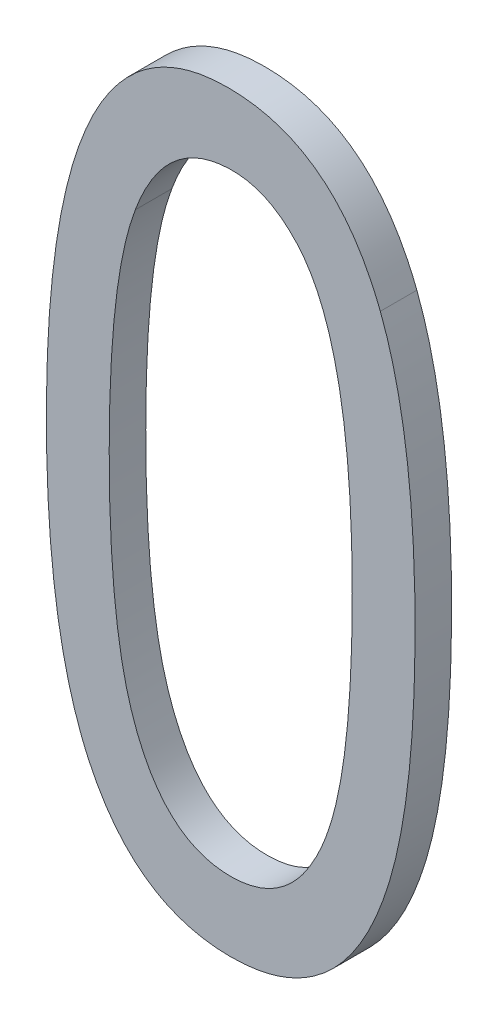
ISO-10303-21;
HEADER;
FILE_DESCRIPTION(('STEP AP214'),'2;1');
FILE_NAME('part.step','',(''),(''),'','','');
FILE_SCHEMA(('AUTOMOTIVE_DESIGN { 1 0 10303 214 1 1 1 1 }'));
ENDSEC;
DATA;
#1=APPLICATION_CONTEXT('core data for automotive mechanical design processes');
#2=APPLICATION_PROTOCOL_DEFINITION('international standard','automotive_design',2000,#1);
#3=PRODUCT_CONTEXT('',#1,'mechanical');
#4=PRODUCT('Part','Part','',(#3));
#5=PRODUCT_RELATED_PRODUCT_CATEGORY('part','',(#4));
#6=PRODUCT_DEFINITION_FORMATION('','',#4);
#7=PRODUCT_DEFINITION_CONTEXT('part definition',#1,'design');
#8=PRODUCT_DEFINITION('design','',#6,#7);
#9=PRODUCT_DEFINITION_SHAPE('','',#8);
#10=(LENGTH_UNIT() NAMED_UNIT(*) SI_UNIT(.MILLI.,.METRE.));
#11=(NAMED_UNIT(*) PLANE_ANGLE_UNIT() SI_UNIT($,.RADIAN.));
#12=(NAMED_UNIT(*) SI_UNIT($,.STERADIAN.) SOLID_ANGLE_UNIT());
#13=UNCERTAINTY_MEASURE_WITH_UNIT(LENGTH_MEASURE(1.E-05),#10,'distance_accuracy_value','');
#14=(GEOMETRIC_REPRESENTATION_CONTEXT(3) GLOBAL_UNCERTAINTY_ASSIGNED_CONTEXT((#13)) GLOBAL_UNIT_ASSIGNED_CONTEXT((#10,
#11,#12)) REPRESENTATION_CONTEXT('',''));
#15=CARTESIAN_POINT('',(0.,0.,0.));
#16=DIRECTION('',(0.,0.,1.));
#17=DIRECTION('',(1.,0.,0.));
#18=AXIS2_PLACEMENT_3D('',#15,#16,#17);
#19=CARTESIAN_POINT('',(179.238825130962,131.090958591415,-38.9997200126349));
#20=DIRECTION('',(0.,0.,-1.));
#21=DIRECTION('',(-1.,0.,0.));
#22=AXIS2_PLACEMENT_3D('',#19,#20,#21);
#23=PLANE('',#22);
#24=CARTESIAN_POINT('',(179.320638807875,130.864264361799,-38.9997200126349));
#25=CARTESIAN_POINT('',(179.314685794643,130.848475242088,-38.9997200126349));
#26=CARTESIAN_POINT('',(179.309419371186,130.832454429874,-38.9997200126349));
#27=CARTESIAN_POINT('',(179.299985103202,130.800117533578,-38.9997200126349));
#28=CARTESIAN_POINT('',(179.295815466405,130.783801978364,-38.9997200126349));
#29=CARTESIAN_POINT('',(179.284520896681,130.73460686473,-38.9997200126349));
#30=CARTESIAN_POINT('',(179.278603230467,130.701457754597,-38.9997200126349));
#31=CARTESIAN_POINT('',(179.267201559346,130.623785000682,-38.9997200126349));
#32=CARTESIAN_POINT('',(179.26251944956,130.579152646366,-38.9997200126349));
#33=CARTESIAN_POINT('',(179.255477133875,130.489674358544,-38.9997200126349));
#34=CARTESIAN_POINT('',(179.253119463016,130.444828245335,-38.9997200126349));
#35=CARTESIAN_POINT('',(179.250054403659,130.355024379923,-38.9997200126349));
#36=CARTESIAN_POINT('',(179.249349284686,130.310066558975,-38.9997200126349));
#37=CARTESIAN_POINT('',(179.2491379072,130.219951978565,-38.9997200126349));
#38=CARTESIAN_POINT('',(179.249636914405,130.174795210432,-38.9997200126349));
#39=CARTESIAN_POINT('',(179.252175301277,130.084581394692,-38.9997200126349));
#40=CARTESIAN_POINT('',(179.254212568807,130.039524295235,-38.9997200126349));
#41=CARTESIAN_POINT('',(179.26045579852,129.949595568297,-38.9997200126349));
#42=CARTESIAN_POINT('',(179.264659382687,129.904723791713,-38.9997200126349));
#43=CARTESIAN_POINT('',(179.275096147828,129.825658047955,-38.9997200126349));
#44=CARTESIAN_POINT('',(179.28064060053,129.791380774313,-38.9997200126349));
#45=CARTESIAN_POINT('',(179.291324308166,129.740489065222,-38.9997200126349));
#46=CARTESIAN_POINT('',(179.295274215558,129.723631408122,-38.9997200126349));
#47=CARTESIAN_POINT('',(179.304286370257,129.690216726647,-38.9997200126349));
#48=CARTESIAN_POINT('',(179.309348434505,129.673659653281,-38.9997200126349));
#49=CARTESIAN_POINT('',(179.322749702284,129.634573217558,-38.9997200126349));
#50=CARTESIAN_POINT('',(179.331598780762,129.612214848004,-38.9997200126349));
#51=CARTESIAN_POINT('',(179.352193685102,129.568817174476,-38.9997200126349));
#52=CARTESIAN_POINT('',(179.363936579213,129.547776562361,-38.9997200126349));
#53=CARTESIAN_POINT('',(179.386027060893,129.515886492571,-38.9997200126349));
#54=CARTESIAN_POINT('',(179.395183289491,129.504222752655,-38.9997200126349));
#55=CARTESIAN_POINT('',(179.415139040853,129.48241448985,-38.9997200126349));
#56=CARTESIAN_POINT('',(179.425934336452,129.472266188477,-38.9997200126349));
#57=CARTESIAN_POINT('',(179.449365366088,129.453957194679,-38.9997200126349));
#58=CARTESIAN_POINT('',(179.462024085917,129.445825341317,-38.9997200126349));
#59=CARTESIAN_POINT('',(179.488738232425,129.432320424252,-38.9997200126349));
#60=CARTESIAN_POINT('',(179.502792597463,129.42694528247,-38.9997200126349));
#61=CARTESIAN_POINT('',(179.529401194421,129.419746445154,-38.9997200126349));
#62=CARTESIAN_POINT('',(179.541844527036,129.417497668166,-38.9997200126349));
#63=CARTESIAN_POINT('',(179.566944901131,129.414881213968,-38.9997200126349));
#64=CARTESIAN_POINT('',(179.579602398832,129.414518250076,-38.9997200126349));
#65=CARTESIAN_POINT('',(179.606269773555,129.415602311855,-38.9997200126349));
#66=CARTESIAN_POINT('',(179.620272695775,129.417256156512,-38.9997200126349));
#67=CARTESIAN_POINT('',(179.647711244464,129.42310198542,-38.9997200126349));
#68=CARTESIAN_POINT('',(179.661148639356,129.427285312832,-38.9997200126349));
#69=CARTESIAN_POINT('',(179.68623709202,129.437840719023,-38.9997200126349));
#70=CARTESIAN_POINT('',(179.697946202855,129.444075574264,-38.9997200126349));
#71=CARTESIAN_POINT('',(179.720124621512,129.458467642927,-38.9997200126349));
#72=CARTESIAN_POINT('',(179.730592026699,129.466627750615,-38.9997200126349));
#73=CARTESIAN_POINT('',(179.753478582907,129.487422160129,-38.9997200126349));
#74=CARTESIAN_POINT('',(179.765364454956,129.500637077797,-38.9997200126349));
#75=CARTESIAN_POINT('',(179.786969151525,129.528773580962,-38.9997200126349));
#76=CARTESIAN_POINT('',(179.796677663589,129.543702801898,-38.9997200126349));
#77=CARTESIAN_POINT('',(179.812914598513,129.572180061341,-38.9997200126349));
#78=CARTESIAN_POINT('',(179.819702637564,129.585584456034,-38.9997200126349));
#79=CARTESIAN_POINT('',(179.832123653542,129.612729594924,-38.9997200126349));
#80=CARTESIAN_POINT('',(179.837769396233,129.626464450378,-38.9997200126349));
#81=CARTESIAN_POINT('',(179.842993005113,129.640336357564,-38.9997200126349));
#82=B_SPLINE_CURVE_WITH_KNOTS('',3,(#24,#25,#26,#27,#28,#29,#30,#31,#32,#33,#34,#35,#36,#37,#38,
#39,#40,#41,#42,#43,#44,#45,#46,#47,#48,#49,#50,#51,#52,#53,#54,#55,#56,#57,#58,#59,#60,#61,#62,
#63,#64,#65,#66,#67,#68,#69,#70,#71,#72,#73,#74,#75,#76,#77,#78,#79,#80,#81),.UNSPECIFIED.,.F.,
.F.,(4,2,2,2,2,2,2,2,2,2,2,2,2,2,2,2,2,2,2,2,2,2,2,2,2,2,2,2,4),(0.,0.0505697521013991,
0.101056346902052,0.201963135015427,0.336501437363995,0.471186305792694,0.60605603492049,
0.741516625664598,0.876791557203544,1.01191830958994,1.11598120562329,1.16789468256163,
1.21979962096606,1.29181096162118,1.36374964472855,1.40810546546208,1.45234877662438,
1.49719243924359,1.5420022477071,1.57977700606879,1.61764613169972,1.65974753133225,
1.70170565331118,1.74128991218937,1.78093406227133,1.83395571191194,1.8872234159135,
1.93225019029305,1.97674197173794),.UNSPECIFIED.);
#83=CARTESIAN_POINT('',(179.320638807875,130.864264361799,-38.9997200126349));
#84=VERTEX_POINT('',#83);
#85=CARTESIAN_POINT('',(179.842993005113,129.640336357564,-38.9997200126349));
#86=VERTEX_POINT('',#85);
#87=EDGE_CURVE('E82',#84,#86,#82,.T.);
#88=ORIENTED_EDGE('',*,*,#87,.F.);
#89=CARTESIAN_POINT('',(179.842993005113,129.640336357564,-38.9997200126349));
#90=CARTESIAN_POINT('',(179.848900545025,129.656132944584,-38.9997200126349));
#91=CARTESIAN_POINT('',(179.854135003658,129.672155401784,-38.9997200126349));
#92=CARTESIAN_POINT('',(179.863523631775,129.70448939799,-38.9997200126349));
#93=CARTESIAN_POINT('',(179.867679515401,129.720800433742,-38.9997200126349));
#94=CARTESIAN_POINT('',(179.878948597557,129.769988651637,-38.9997200126349));
#95=CARTESIAN_POINT('',(179.884867018757,129.803132311392,-38.9997200126349));
#96=CARTESIAN_POINT('',(179.896289019593,129.880830542612,-38.9997200126349));
#97=CARTESIAN_POINT('',(179.900991789311,129.925494025505,-38.9997200126349));
#98=CARTESIAN_POINT('',(179.90807131349,130.015036056765,-38.9997200126349));
#99=CARTESIAN_POINT('',(179.91044551084,130.059914787302,-38.9997200126349));
#100=CARTESIAN_POINT('',(179.913550851396,130.149785676277,-38.9997200126349));
#101=CARTESIAN_POINT('',(179.914279688774,130.194777905545,-38.9997200126349));
#102=CARTESIAN_POINT('',(179.914490656167,130.284934462767,-38.9997200126349));
#103=CARTESIAN_POINT('',(179.913968096369,130.330098802803,-38.9997200126349));
#104=CARTESIAN_POINT('',(179.911231497166,130.420316878215,-38.9997200126349));
#105=CARTESIAN_POINT('',(179.909019919395,130.465370678913,-38.9997200126349));
#106=CARTESIAN_POINT('',(179.902318691174,130.55526623786,-38.9997200126349));
#107=CARTESIAN_POINT('',(179.897831895662,130.600108190934,-38.9997200126349));
#108=CARTESIAN_POINT('',(179.886938256973,130.679049407534,-38.9997200126349));
#109=CARTESIAN_POINT('',(179.881214576846,130.713236890861,-38.9997200126349));
#110=CARTESIAN_POINT('',(179.870480162313,130.764062587247,-38.9997200126349));
#111=CARTESIAN_POINT('',(179.8665449694,130.78092493017,-38.9997200126349));
#112=CARTESIAN_POINT('',(179.857782873257,130.814407870121,-38.9997200126349));
#113=CARTESIAN_POINT('',(179.852956369485,130.831028571859,-38.9997200126349));
#114=CARTESIAN_POINT('',(179.840385853171,130.869406441959,-38.9997200126349));
#115=CARTESIAN_POINT('',(179.832205544478,130.891030440105,-38.9997200126349));
#116=CARTESIAN_POINT('',(179.817835488269,130.922480718343,-38.9997200126349));
#117=CARTESIAN_POINT('',(179.812702496497,130.932788799311,-38.9997200126349));
#118=CARTESIAN_POINT('',(179.801597000204,130.952936420333,-38.9997200126349));
#119=CARTESIAN_POINT('',(179.795625512455,130.962776508817,-38.9997200126349));
#120=CARTESIAN_POINT('',(179.784660620117,130.978844704911,-38.9997200126349));
#121=CARTESIAN_POINT('',(179.779931998641,130.985252237368,-38.9997200126349));
#122=CARTESIAN_POINT('',(179.76996711532,130.997659499494,-38.9997200126349));
#123=CARTESIAN_POINT('',(179.764730584684,131.003659010346,-38.9997200126349));
#124=CARTESIAN_POINT('',(179.748417267788,131.021119267774,-38.9997200126349));
#125=CARTESIAN_POINT('',(179.736737496291,131.032040695328,-38.9997200126349));
#126=CARTESIAN_POINT('',(179.714023817622,131.049727698336,-38.9997200126349));
#127=CARTESIAN_POINT('',(179.70330148318,131.056888521978,-38.9997200126349));
#128=CARTESIAN_POINT('',(179.680841446182,131.069305733308,-38.9997200126349));
#129=CARTESIAN_POINT('',(179.669107595929,131.074568982478,-38.9997200126349));
#130=CARTESIAN_POINT('',(179.644819537951,131.082900861981,-38.9997200126349));
#131=CARTESIAN_POINT('',(179.632262145771,131.08596034952,-38.9997200126349));
#132=CARTESIAN_POINT('',(179.613163387831,131.088835338516,-38.9997200126349));
#133=CARTESIAN_POINT('',(179.606739112858,131.089507543054,-38.9997200126349));
#134=CARTESIAN_POINT('',(179.593855133326,131.090279576979,-38.9997200126349));
#135=CARTESIAN_POINT('',(179.5873954135,131.090379136528,-38.9997200126349));
#136=CARTESIAN_POINT('',(179.568577490339,131.090023396089,-38.9997200126349));
#137=CARTESIAN_POINT('',(179.556224847592,131.088977739146,-38.9997200126349));
#138=CARTESIAN_POINT('',(179.531830978786,131.085060073216,-38.9997200126349));
#139=CARTESIAN_POINT('',(179.519789162678,131.08219183763,-38.9997200126349));
#140=CARTESIAN_POINT('',(179.494617181036,131.07397811753,-38.9997200126349));
#141=CARTESIAN_POINT('',(179.481582449831,131.068333691532,-38.9997200126349));
#142=CARTESIAN_POINT('',(179.456794788347,131.054729287914,-38.9997200126349));
#143=CARTESIAN_POINT('',(179.445042099376,131.046768875404,-38.9997200126349));
#144=CARTESIAN_POINT('',(179.421180625092,131.027490389244,-38.9997200126349));
#145=CARTESIAN_POINT('',(179.409350316107,131.015831683925,-38.9997200126349));
#146=CARTESIAN_POINT('',(179.387660380167,130.99073318987,-38.9997200126349));
#147=CARTESIAN_POINT('',(179.377812649714,130.977283409529,-38.9997200126349));
#148=CARTESIAN_POINT('',(179.358844898035,130.94767383249,-38.9997200126349));
#149=CARTESIAN_POINT('',(179.349939393276,130.931380333798,-38.9997200126349));
#150=CARTESIAN_POINT('',(179.334032894161,130.898196417025,-38.9997200126349));
#151=CARTESIAN_POINT('',(179.327003889302,130.881319595501,-38.9997200126349));
#152=CARTESIAN_POINT('',(179.320638807875,130.864264361799,-38.9997200126349));
#153=B_SPLINE_CURVE_WITH_KNOTS('',3,(#89,#90,#91,#92,#93,#94,#95,#96,#97,#98,#99,#100,#101,#102,
#103,#104,#105,#106,#107,#108,#109,#110,#111,#112,#113,#114,#115,#116,#117,#118,#119,#120,#121,
#122,#123,#124,#125,#126,#127,#128,#129,#130,#131,#132,#133,#134,#135,#136,#137,#138,#139,#140,
#141,#142,#143,#144,#145,#146,#147,#148,#149,#150,#151,#152),.UNSPECIFIED.,.F.,.F.,(4,2,2,2,2,2,
2,2,2,2,2,2,2,2,2,2,2,2,2,2,2,2,2,2,2,2,2,2,2,2,2,4),(0.,0.0505451263481058,0.101009424248054,
0.201902267541713,0.336539886851845,0.471325192870273,0.606299271702893,0.741779978745445,
0.877063607287282,1.01217790073845,1.11607361424897,1.16799878628324,1.21990074317894,
1.28909095466454,1.32360838480802,1.3580843144087,1.38194736016673,1.40582310408443,
1.45357840362639,1.49210254296722,1.53048595084583,1.56902769771647,1.58838285091988,
1.60774712377245,1.64481149010117,1.68179936861829,1.7241515020703,1.76651159345758,
1.81606544779566,1.86590832630645,1.92149301694768,1.97619459018589),.UNSPECIFIED.);
#154=EDGE_CURVE('E80',#86,#84,#153,.T.);
#155=ORIENTED_EDGE('',*,*,#154,.F.);
#156=EDGE_LOOP('',(#88,#155));
#157=FACE_BOUND('',#156,.T.);
#158=CARTESIAN_POINT('',(179.991239144299,130.959023493615,-38.9997200126349));
#159=CARTESIAN_POINT('',(179.997279954319,130.943337899789,-38.9997200126349));
#160=CARTESIAN_POINT('',(180.002861694794,130.927484629563,-38.9997200126349));
#161=CARTESIAN_POINT('',(180.013219112892,130.895528883182,-38.9997200126349));
#162=CARTESIAN_POINT('',(180.017995390848,130.879426602482,-38.9997200126349));
#163=CARTESIAN_POINT('',(180.031264177263,130.830956917848,-38.9997200126349));
#164=CARTESIAN_POINT('',(180.038738661402,130.798312063508,-38.9997200126349));
#165=CARTESIAN_POINT('',(180.05381473309,130.721440274453,-38.9997200126349));
#166=CARTESIAN_POINT('',(180.060591658904,130.677057385156,-38.9997200126349));
#167=CARTESIAN_POINT('',(180.071456152305,130.58792176834,-38.9997200126349));
#168=CARTESIAN_POINT('',(180.07554003602,130.543168618663,-38.9997200126349));
#169=CARTESIAN_POINT('',(180.081649699088,130.453478301139,-38.9997200126349));
#170=CARTESIAN_POINT('',(180.083673145548,130.408540982415,-38.9997200126349));
#171=CARTESIAN_POINT('',(180.086114123818,130.31823868764,-38.9997200126349));
#172=CARTESIAN_POINT('',(180.08651760574,130.272873376238,-38.9997200126349));
#173=CARTESIAN_POINT('',(180.08595999745,130.182200324325,-38.9997200126349));
#174=CARTESIAN_POINT('',(180.085000395862,130.136892575012,-38.9997200126349));
#175=CARTESIAN_POINT('',(180.081319006026,130.046367839625,-38.9997200126349));
#176=CARTESIAN_POINT('',(180.078598284138,130.001150815226,-38.9997200126349));
#177=CARTESIAN_POINT('',(180.071845514524,129.922382201833,-38.9997200126349));
#178=CARTESIAN_POINT('',(180.068322807889,129.888787897993,-38.9997200126349));
#179=CARTESIAN_POINT('',(180.059663899228,129.82181056423,-38.9997200126349));
#180=CARTESIAN_POINT('',(180.05452811688,129.788427481655,-38.9997200126349));
#181=CARTESIAN_POINT('',(180.04224018035,129.72227678713,-38.9997200126349));
#182=CARTESIAN_POINT('',(180.035103266111,129.689506446587,-38.9997200126349));
#183=CARTESIAN_POINT('',(180.018052418192,129.624710527528,-38.9997200126349));
#184=CARTESIAN_POINT('',(180.008141590706,129.592684159116,-38.9997200126349));
#185=CARTESIAN_POINT('',(179.986916223294,129.53507714258,-38.9997200126349));
#186=CARTESIAN_POINT('',(179.976110659592,129.509311580616,-38.9997200126349));
#187=CARTESIAN_POINT('',(179.951590549176,129.4590920697,-38.9997200126349));
#188=CARTESIAN_POINT('',(179.937869433069,129.434641241708,-38.9997200126349));
#189=CARTESIAN_POINT('',(179.906674028944,129.387668977202,-38.9997200126349));
#190=CARTESIAN_POINT('',(179.8891472204,129.36518143479,-38.9997200126349));
#191=CARTESIAN_POINT('',(179.850064515502,129.324076248212,-38.9997200126349));
#192=CARTESIAN_POINT('',(179.82852648136,129.305442191969,-38.9997200126349));
#193=CARTESIAN_POINT('',(179.787884026461,129.277732791769,-38.9997200126349));
#194=CARTESIAN_POINT('',(179.769612641535,129.26743201411,-38.9997200126349));
#195=CARTESIAN_POINT('',(179.731559011488,129.2501474644,-38.9997200126349));
#196=CARTESIAN_POINT('',(179.711776577115,129.243164108632,-38.9997200126349));
#197=CARTESIAN_POINT('',(179.671481891564,129.232565499357,-38.9997200126349));
#198=CARTESIAN_POINT('',(179.650974966847,129.22892949367,-38.9997200126349));
#199=CARTESIAN_POINT('',(179.609623974871,129.224560184324,-38.9997200126349));
#200=CARTESIAN_POINT('',(179.588779113837,129.223835176074,-38.9997200126349));
#201=CARTESIAN_POINT('',(179.54326347764,129.225126635684,-38.9997200126349));
#202=CARTESIAN_POINT('',(179.518603038074,129.227678718281,-38.9997200126349));
#203=CARTESIAN_POINT('',(179.470222641752,129.237298330561,-38.9997200126349));
#204=CARTESIAN_POINT('',(179.446499481735,129.244348751809,-38.9997200126349));
#205=CARTESIAN_POINT('',(179.402467319328,129.262500665746,-38.9997200126349));
#206=CARTESIAN_POINT('',(179.382036419953,129.273305776927,-38.9997200126349));
#207=CARTESIAN_POINT('',(179.343545797162,129.29855698438,-38.9997200126349));
#208=CARTESIAN_POINT('',(179.325489496793,129.313008251029,-38.9997200126349));
#209=CARTESIAN_POINT('',(179.289059250212,129.347562151279,-38.9997200126349));
#210=CARTESIAN_POINT('',(179.271213305426,129.368213821031,-38.9997200126349));
#211=CARTESIAN_POINT('',(179.238999710773,129.412100721718,-38.9997200126349));
#212=CARTESIAN_POINT('',(179.224643056591,129.4353437916,-38.9997200126349));
#213=CARTESIAN_POINT('',(179.204246574083,129.473421924732,-38.9997200126349));
#214=CARTESIAN_POINT('',(179.197225345485,129.487750819333,-38.9997200126349));
#215=CARTESIAN_POINT('',(179.184141578985,129.516708809978,-38.9997200126349));
#216=CARTESIAN_POINT('',(179.178072079893,129.531334747628,-38.9997200126349));
#217=CARTESIAN_POINT('',(179.172392668689,129.546106606373,-38.9997200126349));
#218=B_SPLINE_CURVE_WITH_KNOTS('',3,(#158,#159,#160,#161,#162,#163,#164,#165,#166,#167,#168,
#169,#170,#171,#172,#173,#174,#175,#176,#177,#178,#179,#180,#181,#182,#183,#184,#185,#186,#187,
#188,#189,#190,#191,#192,#193,#194,#195,#196,#197,#198,#199,#200,#201,#202,#203,#204,#205,#206,
#207,#208,#209,#210,#211,#212,#213,#214,#215,#216,#217),.UNSPECIFIED.,.F.,.F.,(4,2,2,2,2,2,2,2,
2,2,2,2,2,2,2,2,2,2,2,2,2,2,2,2,2,2,2,2,2,4),(0.,0.0504059167910866,0.10077409696502,
0.201145630119228,0.335720898441017,0.470479875519735,0.605391261949206,0.741470234259105,
0.877400708844844,1.01324895426801,1.11455472333155,1.21583415718658,1.31636230542943,
1.41677833076473,1.50046425327382,1.58434077728168,1.66945814898841,1.75420517810554,
1.81682345639516,1.87944959019663,1.9416848007098,2.00409723628632,2.07813118924437,
2.1518852353992,2.22079670750336,2.28980645318111,2.37123966682024,2.45292626433536,
2.50076964590169,2.54824488311769),.UNSPECIFIED.);
#219=CARTESIAN_POINT('',(179.991239144299,130.959023493615,-38.9997200126349));
#220=VERTEX_POINT('',#219);
#221=CARTESIAN_POINT('',(179.172392668689,129.546106606373,-38.9997200126349));
#222=VERTEX_POINT('',#221);
#223=EDGE_CURVE('E67',#220,#222,#218,.T.);
#224=ORIENTED_EDGE('',*,*,#223,.F.);
#225=CARTESIAN_POINT('',(179.172392668689,129.546106606373,-38.9997200126349));
#226=CARTESIAN_POINT('',(179.166370248839,129.561795160987,-38.9997200126349));
#227=CARTESIAN_POINT('',(179.160805188863,129.577650211671,-38.9997200126349));
#228=CARTESIAN_POINT('',(179.150477523514,129.609607705384,-38.9997200126349));
#229=CARTESIAN_POINT('',(179.145714325733,129.625709956103,-38.9997200126349));
#230=CARTESIAN_POINT('',(179.132476159521,129.674188332918,-38.9997200126349));
#231=CARTESIAN_POINT('',(179.125014650968,129.706839972945,-38.9997200126349));
#232=CARTESIAN_POINT('',(179.109954533786,129.783735601387,-38.9997200126349));
#233=CARTESIAN_POINT('',(179.1031773126,129.828134722178,-38.9997200126349));
#234=CARTESIAN_POINT('',(179.092299758557,129.917301531891,-38.9997200126349));
#235=CARTESIAN_POINT('',(179.088203066712,129.962069638832,-38.9997200126349));
#236=CARTESIAN_POINT('',(179.082066858733,130.051791461034,-38.9997200126349));
#237=CARTESIAN_POINT('',(179.080029734156,130.096745331349,-38.9997200126349));
#238=CARTESIAN_POINT('',(179.077540897019,130.187059318706,-38.9997200126349));
#239=CARTESIAN_POINT('',(179.077102253894,130.232419758082,-38.9997200126349));
#240=CARTESIAN_POINT('',(179.077672187627,130.323081419516,-38.9997200126349));
#241=CARTESIAN_POINT('',(179.078679123937,130.368382650395,-38.9997200126349));
#242=CARTESIAN_POINT('',(179.082553146114,130.458883307037,-38.9997200126349));
#243=CARTESIAN_POINT('',(179.085418972272,130.504082780957,-38.9997200126349));
#244=CARTESIAN_POINT('',(179.092469763667,130.58277290308,-38.9997200126349));
#245=CARTESIAN_POINT('',(179.09613188189,130.61630973198,-38.9997200126349));
#246=CARTESIAN_POINT('',(179.105060609833,130.683192935084,-38.9997200126349));
#247=CARTESIAN_POINT('',(179.110328032479,130.716539204053,-38.9997200126349));
#248=CARTESIAN_POINT('',(179.122820371233,130.782623358916,-38.9997200126349));
#249=CARTESIAN_POINT('',(179.130030942571,130.815363895091,-38.9997200126349));
#250=CARTESIAN_POINT('',(179.146963557392,130.880176210977,-38.9997200126349));
#251=CARTESIAN_POINT('',(179.156682985665,130.912248649708,-38.9997200126349));
#252=CARTESIAN_POINT('',(179.177396408648,130.969686770112,-38.9997200126349));
#253=CARTESIAN_POINT('',(179.187864284684,130.995238656133,-38.9997200126349));
#254=CARTESIAN_POINT('',(179.211613094858,131.045101119168,-38.9997200126349));
#255=CARTESIAN_POINT('',(179.224899815797,131.06940901299,-38.9997200126349));
#256=CARTESIAN_POINT('',(179.255133397155,131.116209985718,-38.9997200126349));
#257=CARTESIAN_POINT('',(179.27213137979,131.13867098759,-38.9997200126349));
#258=CARTESIAN_POINT('',(179.310138292473,131.179869534896,-38.9997200126349));
#259=CARTESIAN_POINT('',(179.331130239943,131.198622183657,-38.9997200126349));
#260=CARTESIAN_POINT('',(179.370521313183,131.226346206264,-38.9997200126349));
#261=CARTESIAN_POINT('',(179.388027549969,131.236588093705,-38.9997200126349));
#262=CARTESIAN_POINT('',(179.424543714573,131.253879556555,-38.9997200126349));
#263=CARTESIAN_POINT('',(179.443552920858,131.260930652977,-38.9997200126349));
#264=CARTESIAN_POINT('',(179.482354390649,131.271769630551,-38.9997200126349));
#265=CARTESIAN_POINT('',(179.502141886101,131.275574879839,-38.9997200126349));
#266=CARTESIAN_POINT('',(179.54208891462,131.280263216907,-38.9997200126349));
#267=CARTESIAN_POINT('',(179.562249387494,131.281137483228,-38.9997200126349));
#268=CARTESIAN_POINT('',(179.605875414079,131.280450944094,-38.9997200126349));
#269=CARTESIAN_POINT('',(179.629335445731,131.278462935197,-38.9997200126349));
#270=CARTESIAN_POINT('',(179.675586814478,131.270679483559,-38.9997200126349));
#271=CARTESIAN_POINT('',(179.698379826546,131.264894621776,-38.9997200126349));
#272=CARTESIAN_POINT('',(179.743530292553,131.248845032742,-38.9997200126349));
#273=CARTESIAN_POINT('',(179.76582095716,131.238388787963,-38.9997200126349));
#274=CARTESIAN_POINT('',(179.807901612497,131.213282781825,-38.9997200126349));
#275=CARTESIAN_POINT('',(179.827690044012,131.198630424126,-38.9997200126349));
#276=CARTESIAN_POINT('',(179.865813422664,131.164661710575,-38.9997200126349));
#277=CARTESIAN_POINT('',(179.883888011223,131.145057595333,-38.9997200126349));
#278=CARTESIAN_POINT('',(179.916682559377,131.103166812801,-38.9997200126349));
#279=CARTESIAN_POINT('',(179.931390078072,131.080870647637,-38.9997200126349));
#280=CARTESIAN_POINT('',(179.953700916574,131.04186695711,-38.9997200126349));
#281=CARTESIAN_POINT('',(179.962087540968,131.025592244302,-38.9997200126349));
#282=CARTESIAN_POINT('',(179.977561504224,130.992612642449,-38.9997200126349));
#283=CARTESIAN_POINT('',(179.984659897533,130.975912968578,-38.9997200126349));
#284=CARTESIAN_POINT('',(179.991239144299,130.959023493615,-38.9997200126349));
#285=B_SPLINE_CURVE_WITH_KNOTS('',3,(#225,#226,#227,#228,#229,#230,#231,#232,#233,#234,#235,
#236,#237,#238,#239,#240,#241,#242,#243,#244,#245,#246,#247,#248,#249,#250,#251,#252,#253,#254,
#255,#256,#257,#258,#259,#260,#261,#262,#263,#264,#265,#266,#267,#268,#269,#270,#271,#272,#273,
#274,#275,#276,#277,#278,#279,#280,#281,#282,#283,#284),.UNSPECIFIED.,.F.,.F.,(4,2,2,2,2,2,2,2,
2,2,2,2,2,2,2,2,2,2,2,2,2,2,2,2,2,2,2,2,2,4),(0.,0.0503945271737219,0.100751658464276,
0.201135330613622,0.335760109523906,0.4705673741838,0.605530997154548,0.741595659025981,
0.877506026763376,1.01332438845357,1.1145033924107,1.21573371874455,1.3162362943295,
1.4166345270132,1.49934715414898,1.5822312539711,1.6663385498694,1.75009590114854,
1.81064867143636,1.87117254645638,1.93137049679794,1.99174946468789,2.06212675165344,
2.13230874124535,2.20567797210232,2.27909269851185,2.35865332061514,2.43850332819667,
2.49338201730299,2.54776487684637),.UNSPECIFIED.);
#286=EDGE_CURVE('E24',#222,#220,#285,.T.);
#287=ORIENTED_EDGE('',*,*,#286,.F.);
#288=EDGE_LOOP('',(#224,#287));
#289=FACE_BOUND('',#288,.T.);
#290=ADVANCED_FACE('F17',(#157,#289),#23,.F.);
#291=CARTESIAN_POINT('',(179.991239144299,130.959023493615,-39.0997200126349));
#292=CARTESIAN_POINT('',(179.991239144299,130.959023493615,-38.9997200126349));
#293=CARTESIAN_POINT('',(179.907802181145,131.173422646606,-39.0997200126349));
#294=CARTESIAN_POINT('',(179.907802181145,131.173422646606,-38.9997200126349));
#295=CARTESIAN_POINT('',(179.768481856621,131.280886913413,-39.0997200126349));
#296=CARTESIAN_POINT('',(179.768481856621,131.280886913413,-38.9997200126349));
#297=CARTESIAN_POINT('',(179.243023028196,131.280886913413,-39.0997200126349));
#298=CARTESIAN_POINT('',(179.243023028196,131.280886913413,-38.9997200126349));
#299=CARTESIAN_POINT('',(179.077313338582,130.938377649253,-39.0997200126349));
#300=CARTESIAN_POINT('',(179.077313338582,130.938377649253,-38.9997200126349));
#301=CARTESIAN_POINT('',(179.077313338582,129.946318358623,-39.0997200126349));
#302=CARTESIAN_POINT('',(179.077313338582,129.946318358623,-38.9997200126349));
#303=CARTESIAN_POINT('',(179.109135808251,129.710743980645,-39.0997200126349));
#304=CARTESIAN_POINT('',(179.109135808251,129.710743980645,-38.9997200126349));
#305=CARTESIAN_POINT('',(179.172392668689,129.546106606373,-39.0997200126349));
#306=CARTESIAN_POINT('',(179.172392668689,129.546106606373,-38.9997200126349));
#307=B_SPLINE_SURFACE_WITH_KNOTS('',3,1,((#291,#292),(#293,#294),(#295,#296),(#297,#298),(#299,
#300),(#301,#302),(#303,#304),(#305,#306)),.UNSPECIFIED.,.F.,.F.,.F.,(4,2,2,4),(2,2),(0.,
0.288697589169659,0.78023260625893,1.),(1.,1.09999999999999),.UNSPECIFIED.);
#308=CARTESIAN_POINT('',(179.172392668689,129.546106606373,-39.0997200126349));
#309=CARTESIAN_POINT('',(179.166370248839,129.561795160987,-39.0997200126349));
#310=CARTESIAN_POINT('',(179.160805188863,129.577650211671,-39.0997200126349));
#311=CARTESIAN_POINT('',(179.150477523514,129.609607705384,-39.0997200126349));
#312=CARTESIAN_POINT('',(179.145714325733,129.625709956103,-39.0997200126349));
#313=CARTESIAN_POINT('',(179.132476159521,129.674188332918,-39.0997200126349));
#314=CARTESIAN_POINT('',(179.125014650968,129.706839972945,-39.0997200126349));
#315=CARTESIAN_POINT('',(179.109954533786,129.783735601387,-39.0997200126349));
#316=CARTESIAN_POINT('',(179.1031773126,129.828134722178,-39.0997200126349));
#317=CARTESIAN_POINT('',(179.092299758557,129.917301531891,-39.0997200126349));
#318=CARTESIAN_POINT('',(179.088203066712,129.962069638832,-39.0997200126349));
#319=CARTESIAN_POINT('',(179.082066858733,130.051791461034,-39.0997200126349));
#320=CARTESIAN_POINT('',(179.080029734156,130.096745331349,-39.0997200126349));
#321=CARTESIAN_POINT('',(179.077540897019,130.187059318706,-39.0997200126349));
#322=CARTESIAN_POINT('',(179.077102253894,130.232419758082,-39.0997200126349));
#323=CARTESIAN_POINT('',(179.077672187628,130.323081419516,-39.0997200126349));
#324=CARTESIAN_POINT('',(179.078679123937,130.368382650395,-39.0997200126349));
#325=CARTESIAN_POINT('',(179.082553146114,130.458883307037,-39.0997200126349));
#326=CARTESIAN_POINT('',(179.085418972272,130.504082780957,-39.0997200126349));
#327=CARTESIAN_POINT('',(179.092469763667,130.58277290308,-39.0997200126349));
#328=CARTESIAN_POINT('',(179.09613188189,130.61630973198,-39.0997200126349));
#329=CARTESIAN_POINT('',(179.105060609833,130.683192935084,-39.0997200126349));
#330=CARTESIAN_POINT('',(179.110328032479,130.716539204053,-39.0997200126349));
#331=CARTESIAN_POINT('',(179.122820371233,130.782623358916,-39.0997200126349));
#332=CARTESIAN_POINT('',(179.130030942571,130.815363895091,-39.0997200126349));
#333=CARTESIAN_POINT('',(179.146963557392,130.880176210977,-39.0997200126349));
#334=CARTESIAN_POINT('',(179.156682985665,130.912248649708,-39.0997200126349));
#335=CARTESIAN_POINT('',(179.177396408648,130.969686770112,-39.0997200126349));
#336=CARTESIAN_POINT('',(179.187864284684,130.995238656133,-39.0997200126349));
#337=CARTESIAN_POINT('',(179.211613094858,131.045101119168,-39.0997200126349));
#338=CARTESIAN_POINT('',(179.224899815797,131.06940901299,-39.0997200126349));
#339=CARTESIAN_POINT('',(179.255133397155,131.116209985718,-39.0997200126349));
#340=CARTESIAN_POINT('',(179.27213137979,131.13867098759,-39.0997200126349));
#341=CARTESIAN_POINT('',(179.310138292473,131.179869534896,-39.0997200126349));
#342=CARTESIAN_POINT('',(179.331130239943,131.198622183657,-39.0997200126349));
#343=CARTESIAN_POINT('',(179.370521313183,131.226346206264,-39.0997200126349));
#344=CARTESIAN_POINT('',(179.388027549969,131.236588093705,-39.0997200126349));
#345=CARTESIAN_POINT('',(179.424543714573,131.253879556555,-39.0997200126349));
#346=CARTESIAN_POINT('',(179.443552920858,131.260930652977,-39.0997200126349));
#347=CARTESIAN_POINT('',(179.482354390649,131.271769630551,-39.0997200126349));
#348=CARTESIAN_POINT('',(179.502141886101,131.275574879839,-39.0997200126349));
#349=CARTESIAN_POINT('',(179.54208891462,131.280263216907,-39.0997200126349));
#350=CARTESIAN_POINT('',(179.562249387494,131.281137483228,-39.0997200126349));
#351=CARTESIAN_POINT('',(179.605875414079,131.280450944094,-39.0997200126349));
#352=CARTESIAN_POINT('',(179.629335445731,131.278462935197,-39.0997200126349));
#353=CARTESIAN_POINT('',(179.675586814478,131.270679483559,-39.0997200126349));
#354=CARTESIAN_POINT('',(179.698379826546,131.264894621777,-39.0997200126349));
#355=CARTESIAN_POINT('',(179.743530292553,131.248845032742,-39.0997200126349));
#356=CARTESIAN_POINT('',(179.76582095716,131.238388787963,-39.0997200126349));
#357=CARTESIAN_POINT('',(179.807901612497,131.213282781824,-39.0997200126349));
#358=CARTESIAN_POINT('',(179.827690044012,131.198630424126,-39.0997200126349));
#359=CARTESIAN_POINT('',(179.865813422664,131.164661710575,-39.0997200126349));
#360=CARTESIAN_POINT('',(179.883888011222,131.145057595333,-39.0997200126349));
#361=CARTESIAN_POINT('',(179.916682559377,131.103166812801,-39.0997200126349));
#362=CARTESIAN_POINT('',(179.931390078072,131.080870647637,-39.0997200126349));
#363=CARTESIAN_POINT('',(179.953700916574,131.04186695711,-39.0997200126349));
#364=CARTESIAN_POINT('',(179.962087540968,131.025592244302,-39.0997200126349));
#365=CARTESIAN_POINT('',(179.977561504224,130.992612642449,-39.0997200126349));
#366=CARTESIAN_POINT('',(179.984659897533,130.975912968578,-39.0997200126349));
#367=CARTESIAN_POINT('',(179.991239144299,130.959023493615,-39.0997200126349));
#368=B_SPLINE_CURVE_WITH_KNOTS('',3,(#308,#309,#310,#311,#312,#313,#314,#315,#316,#317,#318,
#319,#320,#321,#322,#323,#324,#325,#326,#327,#328,#329,#330,#331,#332,#333,#334,#335,#336,#337,
#338,#339,#340,#341,#342,#343,#344,#345,#346,#347,#348,#349,#350,#351,#352,#353,#354,#355,#356,
#357,#358,#359,#360,#361,#362,#363,#364,#365,#366,#367),.UNSPECIFIED.,.F.,.F.,(4,2,2,2,2,2,2,2,
2,2,2,2,2,2,2,2,2,2,2,2,2,2,2,2,2,2,2,2,2,4),(0.,0.0503945271737034,0.100751658464255,
0.201135330613621,0.335760109523901,0.470567374183798,0.605530997154547,0.741595659025979,
0.877506026763375,1.01332438845357,1.1145033924107,1.21573371874454,1.31623629432947,
1.41663452701319,1.49934715414898,1.5822312539711,1.66633854986938,1.75009590114855,
1.81064867143628,1.87117254645627,1.93137049679791,1.99174946468792,2.0621267516535,
2.13230874124539,2.20567797210231,2.27909269851185,2.35865332061516,2.43850332819668,
2.49338201730297,2.54776487684637),.UNSPECIFIED.);
#369=CARTESIAN_POINT('',(179.172392668689,129.546106606373,-39.0997200126349));
#370=VERTEX_POINT('',#369);
#371=CARTESIAN_POINT('',(179.991239144299,130.959023493615,-39.0997200126349));
#372=VERTEX_POINT('',#371);
#373=EDGE_CURVE('E111',#370,#372,#368,.T.);
#374=DIRECTION('',(0.,0.,-1.));
#375=VECTOR('',#374,1.);
#376=CARTESIAN_POINT('',(179.172392668689,129.546106606373,-39.0497200126349));
#377=LINE('',#376,#375);
#378=EDGE_CURVE('E71',#222,#370,#377,.T.);
#379=DIRECTION('',(0.,0.,1.));
#380=VECTOR('',#379,1.);
#381=CARTESIAN_POINT('',(179.991239144299,130.959023493615,-39.0497200126349));
#382=LINE('',#381,#380);
#383=EDGE_CURVE('E74',#372,#220,#382,.T.);
#384=ORIENTED_EDGE('',*,*,#373,.F.);
#385=ORIENTED_EDGE('',*,*,#378,.F.);
#386=ORIENTED_EDGE('',*,*,#286,.T.);
#387=ORIENTED_EDGE('',*,*,#383,.F.);
#388=EDGE_LOOP('',(#384,#385,#386,#387));
#389=FACE_BOUND('',#388,.T.);
#390=ADVANCED_FACE('F73',(#389),#307,.T.);
#391=CARTESIAN_POINT('',(179.172392668689,129.546106606373,-39.0997200126349));
#392=CARTESIAN_POINT('',(179.172392668689,129.546106606373,-38.9997200126349));
#393=CARTESIAN_POINT('',(179.255133609732,129.330758402497,-39.0997200126349));
#394=CARTESIAN_POINT('',(179.255133609732,129.330758402497,-38.9997200126349));
#395=CARTESIAN_POINT('',(179.392433404078,129.224243186574,-39.0997200126349));
#396=CARTESIAN_POINT('',(179.392433404078,129.224243186574,-38.9997200126349));
#397=CARTESIAN_POINT('',(179.786721564846,129.224243186574,-39.0997200126349));
#398=CARTESIAN_POINT('',(179.786721564846,129.224243186574,-38.9997200126349));
#399=CARTESIAN_POINT('',(179.929922678353,129.350235775245,-39.0997200126349));
#400=CARTESIAN_POINT('',(179.929922678353,129.350235775245,-38.9997200126349));
#401=CARTESIAN_POINT('',(180.061324097569,129.760432026344,-39.0997200126349));
#402=CARTESIAN_POINT('',(180.061324097569,129.760432026344,-38.9997200126349));
#403=CARTESIAN_POINT('',(180.086318474406,129.977551815478,-39.0997200126349));
#404=CARTESIAN_POINT('',(180.086318474406,129.977551815478,-38.9997200126349));
#405=CARTESIAN_POINT('',(180.086318474406,130.560399883239,-39.0997200126349));
#406=CARTESIAN_POINT('',(180.086318474406,130.560399883239,-38.9997200126349));
#407=CARTESIAN_POINT('',(180.054496004737,130.794915499967,-39.0997200126349));
#408=CARTESIAN_POINT('',(180.054496004737,130.794915499967,-38.9997200126349));
#409=CARTESIAN_POINT('',(179.991239144299,130.959023493615,-39.0997200126349));
#410=CARTESIAN_POINT('',(179.991239144299,130.959023493615,-38.9997200126349));
#411=B_SPLINE_SURFACE_WITH_KNOTS('',3,1,((#391,#392),(#393,#394),(#395,#396),(#397,#398),(#399,
#400),(#401,#402),(#403,#404),(#405,#406),(#407,#408),(#409,#410)),.UNSPECIFIED.,.F.,.F.,.F.,(4,
2,2,2,4),(2,2),(0.,0.28393143238996,0.592349764493229,0.785992882722152,1.),(1.,
1.09999999999999),.UNSPECIFIED.);
#412=CARTESIAN_POINT('',(179.991239144299,130.959023493615,-39.0997200126349));
#413=CARTESIAN_POINT('',(179.997279954319,130.943337899789,-39.0997200126349));
#414=CARTESIAN_POINT('',(180.002861694794,130.927484629563,-39.0997200126349));
#415=CARTESIAN_POINT('',(180.013219112892,130.895528883182,-39.0997200126349));
#416=CARTESIAN_POINT('',(180.017995390848,130.879426602482,-39.0997200126349));
#417=CARTESIAN_POINT('',(180.031264177263,130.830956917848,-39.0997200126349));
#418=CARTESIAN_POINT('',(180.038738661402,130.798312063508,-39.0997200126349));
#419=CARTESIAN_POINT('',(180.05381473309,130.721440274453,-39.0997200126349));
#420=CARTESIAN_POINT('',(180.060591658904,130.677057385156,-39.0997200126349));
#421=CARTESIAN_POINT('',(180.071456152305,130.58792176834,-39.0997200126349));
#422=CARTESIAN_POINT('',(180.07554003602,130.543168618663,-39.0997200126349));
#423=CARTESIAN_POINT('',(180.081649699088,130.453478301139,-39.0997200126349));
#424=CARTESIAN_POINT('',(180.083673145548,130.408540982415,-39.0997200126349));
#425=CARTESIAN_POINT('',(180.086114123818,130.31823868764,-39.0997200126349));
#426=CARTESIAN_POINT('',(180.08651760574,130.272873376238,-39.0997200126349));
#427=CARTESIAN_POINT('',(180.08595999745,130.182200324325,-39.0997200126349));
#428=CARTESIAN_POINT('',(180.085000395862,130.136892575012,-39.0997200126349));
#429=CARTESIAN_POINT('',(180.081319006026,130.046367839625,-39.0997200126349));
#430=CARTESIAN_POINT('',(180.078598284138,130.001150815226,-39.0997200126349));
#431=CARTESIAN_POINT('',(180.071845514524,129.922382201833,-39.0997200126349));
#432=CARTESIAN_POINT('',(180.068322807889,129.888787897993,-39.0997200126349));
#433=CARTESIAN_POINT('',(180.059663899228,129.82181056423,-39.0997200126349));
#434=CARTESIAN_POINT('',(180.05452811688,129.788427481655,-39.0997200126349));
#435=CARTESIAN_POINT('',(180.04224018035,129.72227678713,-39.0997200126349));
#436=CARTESIAN_POINT('',(180.035103266111,129.689506446587,-39.0997200126349));
#437=CARTESIAN_POINT('',(180.018052418192,129.624710527528,-39.0997200126349));
#438=CARTESIAN_POINT('',(180.008141590706,129.592684159116,-39.0997200126349));
#439=CARTESIAN_POINT('',(179.986916223294,129.53507714258,-39.0997200126349));
#440=CARTESIAN_POINT('',(179.976110659592,129.509311580616,-39.0997200126349));
#441=CARTESIAN_POINT('',(179.951590549176,129.4590920697,-39.0997200126349));
#442=CARTESIAN_POINT('',(179.937869433068,129.434641241708,-39.0997200126349));
#443=CARTESIAN_POINT('',(179.906674028944,129.387668977202,-39.0997200126349));
#444=CARTESIAN_POINT('',(179.8891472204,129.36518143479,-39.0997200126349));
#445=CARTESIAN_POINT('',(179.850064515502,129.324076248212,-39.0997200126349));
#446=CARTESIAN_POINT('',(179.82852648136,129.305442191969,-39.0997200126349));
#447=CARTESIAN_POINT('',(179.787884026461,129.277732791769,-39.0997200126349));
#448=CARTESIAN_POINT('',(179.769612641535,129.26743201411,-39.0997200126349));
#449=CARTESIAN_POINT('',(179.731559011488,129.2501474644,-39.0997200126349));
#450=CARTESIAN_POINT('',(179.711776577115,129.243164108632,-39.0997200126349));
#451=CARTESIAN_POINT('',(179.671481891564,129.232565499357,-39.0997200126349));
#452=CARTESIAN_POINT('',(179.650974966847,129.22892949367,-39.0997200126349));
#453=CARTESIAN_POINT('',(179.609623974871,129.224560184324,-39.0997200126349));
#454=CARTESIAN_POINT('',(179.588779113837,129.223835176074,-39.0997200126349));
#455=CARTESIAN_POINT('',(179.54326347764,129.225126635684,-39.0997200126349));
#456=CARTESIAN_POINT('',(179.518603038074,129.227678718281,-39.0997200126349));
#457=CARTESIAN_POINT('',(179.470222641752,129.237298330562,-39.0997200126349));
#458=CARTESIAN_POINT('',(179.446499481735,129.244348751809,-39.0997200126349));
#459=CARTESIAN_POINT('',(179.402467319328,129.262500665746,-39.0997200126349));
#460=CARTESIAN_POINT('',(179.382036419953,129.273305776927,-39.0997200126349));
#461=CARTESIAN_POINT('',(179.343545797162,129.29855698438,-39.0997200126349));
#462=CARTESIAN_POINT('',(179.325489496793,129.313008251029,-39.0997200126349));
#463=CARTESIAN_POINT('',(179.289059250212,129.347562151279,-39.0997200126349));
#464=CARTESIAN_POINT('',(179.271213305426,129.368213821031,-39.0997200126349));
#465=CARTESIAN_POINT('',(179.238999710773,129.412100721718,-39.0997200126349));
#466=CARTESIAN_POINT('',(179.224643056591,129.4353437916,-39.0997200126349));
#467=CARTESIAN_POINT('',(179.204246574083,129.473421924732,-39.0997200126349));
#468=CARTESIAN_POINT('',(179.197225345485,129.487750819333,-39.0997200126349));
#469=CARTESIAN_POINT('',(179.184141578985,129.516708809978,-39.0997200126349));
#470=CARTESIAN_POINT('',(179.178072079893,129.531334747628,-39.0997200126349));
#471=CARTESIAN_POINT('',(179.172392668689,129.546106606373,-39.0997200126349));
#472=B_SPLINE_CURVE_WITH_KNOTS('',3,(#412,#413,#414,#415,#416,#417,#418,#419,#420,#421,#422,
#423,#424,#425,#426,#427,#428,#429,#430,#431,#432,#433,#434,#435,#436,#437,#438,#439,#440,#441,
#442,#443,#444,#445,#446,#447,#448,#449,#450,#451,#452,#453,#454,#455,#456,#457,#458,#459,#460,
#461,#462,#463,#464,#465,#466,#467,#468,#469,#470,#471),.UNSPECIFIED.,.F.,.F.,(4,2,2,2,2,2,2,2,
2,2,2,2,2,2,2,2,2,2,2,2,2,2,2,2,2,2,2,2,2,4),(0.,0.0504059167910943,0.100774096965017,
0.201145630119225,0.335720898441009,0.470479875519728,0.605391261949198,0.741470234259098,
0.877400708844839,1.01324895426801,1.11455472333155,1.21583415718657,1.3163623054294,
1.41677833076472,1.50046425327383,1.58434077728166,1.6694581489884,1.75420517810554,
1.81682345639516,1.87944959019663,1.94168480070979,2.00409723628631,2.07813118924437,
2.15188523539918,2.22079670750332,2.28980645318108,2.3712396668203,2.4529262643355,
2.50076964590173,2.54824488311769),.UNSPECIFIED.);
#473=EDGE_CURVE('E78',#372,#370,#472,.T.);
#474=ORIENTED_EDGE('',*,*,#473,.F.);
#475=ORIENTED_EDGE('',*,*,#383,.T.);
#476=ORIENTED_EDGE('',*,*,#223,.T.);
#477=ORIENTED_EDGE('',*,*,#378,.T.);
#478=EDGE_LOOP('',(#474,#475,#476,#477));
#479=FACE_BOUND('',#478,.T.);
#480=ADVANCED_FACE('F76',(#479),#411,.T.);
#481=CARTESIAN_POINT('',(179.320638807875,130.864264361799,-39.0997200126349));
#482=CARTESIAN_POINT('',(179.320638807875,130.864264361799,-38.9997200126349));
#483=CARTESIAN_POINT('',(179.376522169244,131.014608459205,-39.0997200126349));
#484=CARTESIAN_POINT('',(179.376522169244,131.014608459205,-38.9997200126349));
#485=CARTESIAN_POINT('',(179.465004158078,131.090309888533,-39.0997200126349));
#486=CARTESIAN_POINT('',(179.465004158078,131.090309888533,-38.9997200126349));
#487=CARTESIAN_POINT('',(179.656715133884,131.090309888533,-39.0997200126349));
#488=CARTESIAN_POINT('',(179.656715133884,131.090309888533,-38.9997200126349));
#489=CARTESIAN_POINT('',(179.718807757627,131.058547051052,-39.0997200126349));
#490=CARTESIAN_POINT('',(179.718807757627,131.058547051052,-38.9997200126349));
#491=CARTESIAN_POINT('',(179.866468820786,130.882299919591,-39.0997200126349));
#492=CARTESIAN_POINT('',(179.866468820786,130.882299919591,-38.9997200126349));
#493=CARTESIAN_POINT('',(179.914399522417,130.634513170693,-39.0997200126349));
#494=CARTESIAN_POINT('',(179.914399522417,130.634513170693,-38.9997200126349));
#495=CARTESIAN_POINT('',(179.914399522417,129.971199247982,-39.0997200126349));
#496=CARTESIAN_POINT('',(179.914399522417,129.971199247982,-38.9997200126349));
#497=CARTESIAN_POINT('',(179.890726709615,129.767387707484,-39.0997200126349));
#498=CARTESIAN_POINT('',(179.890726709615,129.767387707484,-38.9997200126349));
#499=CARTESIAN_POINT('',(179.842993005113,129.640336357564,-39.0997200126349));
#500=CARTESIAN_POINT('',(179.842993005113,129.640336357564,-38.9997200126349));
#501=B_SPLINE_SURFACE_WITH_KNOTS('',3,1,((#481,#482),(#483,#484),(#485,#486),(#487,#488),(#489,
#490),(#491,#492),(#493,#494),(#495,#496),(#497,#498),(#499,#500)),.UNSPECIFIED.,.F.,.F.,.F.,(4,
2,2,2,4),(2,2),(0.,0.295863483883651,0.466953869132658,0.774529569545337,1.),(1.,
1.09999999999999),.UNSPECIFIED.);
#502=CARTESIAN_POINT('',(179.842993005113,129.640336357564,-39.0997200126349));
#503=CARTESIAN_POINT('',(179.848900545025,129.656132944584,-39.0997200126349));
#504=CARTESIAN_POINT('',(179.854135003658,129.672155401784,-39.0997200126349));
#505=CARTESIAN_POINT('',(179.863523631775,129.70448939799,-39.0997200126349));
#506=CARTESIAN_POINT('',(179.867679515401,129.720800433742,-39.0997200126349));
#507=CARTESIAN_POINT('',(179.878948597557,129.769988651637,-39.0997200126349));
#508=CARTESIAN_POINT('',(179.884867018757,129.803132311392,-39.0997200126349));
#509=CARTESIAN_POINT('',(179.896289019593,129.880830542612,-39.0997200126349));
#510=CARTESIAN_POINT('',(179.900991789311,129.925494025505,-39.0997200126349));
#511=CARTESIAN_POINT('',(179.90807131349,130.015036056765,-39.0997200126349));
#512=CARTESIAN_POINT('',(179.91044551084,130.059914787302,-39.0997200126349));
#513=CARTESIAN_POINT('',(179.913550851396,130.149785676277,-39.0997200126349));
#514=CARTESIAN_POINT('',(179.914279688774,130.194777905545,-39.0997200126349));
#515=CARTESIAN_POINT('',(179.914490656167,130.284934462767,-39.0997200126349));
#516=CARTESIAN_POINT('',(179.913968096369,130.330098802803,-39.0997200126349));
#517=CARTESIAN_POINT('',(179.911231497166,130.420316878215,-39.0997200126349));
#518=CARTESIAN_POINT('',(179.909019919395,130.465370678913,-39.0997200126349));
#519=CARTESIAN_POINT('',(179.902318691174,130.55526623786,-39.0997200126349));
#520=CARTESIAN_POINT('',(179.897831895662,130.600108190934,-39.0997200126349));
#521=CARTESIAN_POINT('',(179.886938256973,130.679049407534,-39.0997200126349));
#522=CARTESIAN_POINT('',(179.881214576846,130.713236890861,-39.0997200126349));
#523=CARTESIAN_POINT('',(179.870480162313,130.764062587247,-39.0997200126349));
#524=CARTESIAN_POINT('',(179.8665449694,130.78092493017,-39.0997200126349));
#525=CARTESIAN_POINT('',(179.857782873257,130.814407870121,-39.0997200126349));
#526=CARTESIAN_POINT('',(179.852956369485,130.831028571859,-39.0997200126349));
#527=CARTESIAN_POINT('',(179.840385853171,130.869406441959,-39.0997200126349));
#528=CARTESIAN_POINT('',(179.832205544478,130.891030440105,-39.0997200126349));
#529=CARTESIAN_POINT('',(179.817835488269,130.922480718343,-39.0997200126349));
#530=CARTESIAN_POINT('',(179.812702496497,130.932788799311,-39.0997200126349));
#531=CARTESIAN_POINT('',(179.801597000204,130.952936420333,-39.0997200126349));
#532=CARTESIAN_POINT('',(179.795625512455,130.962776508817,-39.0997200126349));
#533=CARTESIAN_POINT('',(179.784660620117,130.978844704911,-39.0997200126349));
#534=CARTESIAN_POINT('',(179.779931998641,130.985252237368,-39.0997200126349));
#535=CARTESIAN_POINT('',(179.76996711532,130.997659499494,-39.0997200126349));
#536=CARTESIAN_POINT('',(179.764730584684,131.003659010346,-39.0997200126349));
#537=CARTESIAN_POINT('',(179.748417267788,131.021119267774,-39.0997200126349));
#538=CARTESIAN_POINT('',(179.736737496291,131.032040695328,-39.0997200126349));
#539=CARTESIAN_POINT('',(179.714023817622,131.049727698336,-39.0997200126349));
#540=CARTESIAN_POINT('',(179.70330148318,131.056888521978,-39.0997200126349));
#541=CARTESIAN_POINT('',(179.680841446182,131.069305733308,-39.0997200126349));
#542=CARTESIAN_POINT('',(179.669107595929,131.074568982478,-39.0997200126349));
#543=CARTESIAN_POINT('',(179.644819537951,131.082900861981,-39.0997200126349));
#544=CARTESIAN_POINT('',(179.632262145771,131.08596034952,-39.0997200126349));
#545=CARTESIAN_POINT('',(179.613163387831,131.088835338516,-39.0997200126349));
#546=CARTESIAN_POINT('',(179.606739112858,131.089507543054,-39.0997200126349));
#547=CARTESIAN_POINT('',(179.593855133326,131.090279576979,-39.0997200126349));
#548=CARTESIAN_POINT('',(179.5873954135,131.090379136528,-39.0997200126349));
#549=CARTESIAN_POINT('',(179.568577490339,131.090023396089,-39.0997200126349));
#550=CARTESIAN_POINT('',(179.556224847592,131.088977739146,-39.0997200126349));
#551=CARTESIAN_POINT('',(179.531830978786,131.085060073216,-39.0997200126349));
#552=CARTESIAN_POINT('',(179.519789162678,131.08219183763,-39.0997200126349));
#553=CARTESIAN_POINT('',(179.494617181036,131.07397811753,-39.0997200126349));
#554=CARTESIAN_POINT('',(179.481582449831,131.068333691532,-39.0997200126349));
#555=CARTESIAN_POINT('',(179.456794788347,131.054729287914,-39.0997200126349));
#556=CARTESIAN_POINT('',(179.445042099376,131.046768875404,-39.0997200126349));
#557=CARTESIAN_POINT('',(179.421180625092,131.027490389244,-39.0997200126349));
#558=CARTESIAN_POINT('',(179.409350316107,131.015831683925,-39.0997200126349));
#559=CARTESIAN_POINT('',(179.387660380167,130.99073318987,-39.0997200126349));
#560=CARTESIAN_POINT('',(179.377812649714,130.977283409529,-39.0997200126349));
#561=CARTESIAN_POINT('',(179.358844898035,130.94767383249,-39.0997200126349));
#562=CARTESIAN_POINT('',(179.349939393276,130.931380333798,-39.0997200126349));
#563=CARTESIAN_POINT('',(179.334032894161,130.898196417025,-39.0997200126349));
#564=CARTESIAN_POINT('',(179.327003889302,130.881319595501,-39.0997200126349));
#565=CARTESIAN_POINT('',(179.320638807875,130.864264361799,-39.0997200126349));
#566=B_SPLINE_CURVE_WITH_KNOTS('',3,(#502,#503,#504,#505,#506,#507,#508,#509,#510,#511,#512,
#513,#514,#515,#516,#517,#518,#519,#520,#521,#522,#523,#524,#525,#526,#527,#528,#529,#530,#531,
#532,#533,#534,#535,#536,#537,#538,#539,#540,#541,#542,#543,#544,#545,#546,#547,#548,#549,#550,
#551,#552,#553,#554,#555,#556,#557,#558,#559,#560,#561,#562,#563,#564,#565),.UNSPECIFIED.,.F.,
.F.,(4,2,2,2,2,2,2,2,2,2,2,2,2,2,2,2,2,2,2,2,2,2,2,2,2,2,2,2,2,2,2,4),(0.,0.0505451263481058,
0.101009424248054,0.201902267541713,0.336539886851845,0.471325192870273,0.606299271702893,
0.741779978745444,0.87706360728728,1.01217790073845,1.11607361424897,1.16799878628324,
1.21990074317894,1.28909095466455,1.32360838480803,1.3580843144087,1.38194736016673,
1.40582310408441,1.45357840362635,1.49210254296721,1.53048595084584,1.56902769771651,
1.58838285091993,1.60774712377251,1.64481149010114,1.68179936861818,1.72415150207024,
1.76651159345752,1.81606544779561,1.86590832630642,1.92149301694764,1.97619459018589),.UNSPECIFIED.);
#567=CARTESIAN_POINT('',(179.842993005113,129.640336357564,-39.0997200126349));
#568=VERTEX_POINT('',#567);
#569=CARTESIAN_POINT('',(179.320638807875,130.864264361799,-39.0997200126349));
#570=VERTEX_POINT('',#569);
#571=EDGE_CURVE('E36',#568,#570,#566,.T.);
#572=DIRECTION('',(0.,0.,-1.));
#573=VECTOR('',#572,1.);
#574=CARTESIAN_POINT('',(179.842993005113,129.640336357564,-39.0497200126349));
#575=LINE('',#574,#573);
#576=EDGE_CURVE('E168',#86,#568,#575,.T.);
#577=DIRECTION('',(0.,0.,1.));
#578=VECTOR('',#577,1.);
#579=CARTESIAN_POINT('',(179.320638807875,130.864264361799,-39.0497200126349));
#580=LINE('',#579,#578);
#581=EDGE_CURVE('E45',#570,#84,#580,.T.);
#582=ORIENTED_EDGE('',*,*,#571,.F.);
#583=ORIENTED_EDGE('',*,*,#576,.F.);
#584=ORIENTED_EDGE('',*,*,#154,.T.);
#585=ORIENTED_EDGE('',*,*,#581,.F.);
#586=EDGE_LOOP('',(#582,#583,#584,#585));
#587=FACE_BOUND('',#586,.T.);
#588=ADVANCED_FACE('F135',(#587),#501,.T.);
#589=CARTESIAN_POINT('',(179.842993005113,129.640336357564,-39.0997200126349));
#590=CARTESIAN_POINT('',(179.842993005113,129.640336357564,-38.9997200126349));
#591=CARTESIAN_POINT('',(179.786582178351,129.490189375154,-39.0997200126349));
#592=CARTESIAN_POINT('',(179.786582178351,129.490189375154,-38.9997200126349));
#593=CARTESIAN_POINT('',(179.700179970504,129.414820211455,-39.0997200126349));
#594=CARTESIAN_POINT('',(179.700179970504,129.414820211455,-38.9997200126349));
#595=CARTESIAN_POINT('',(179.452973712227,129.414820211455,-39.0997200126349));
#596=CARTESIAN_POINT('',(179.452973712227,129.414820211455,-38.9997200126349));
#597=CARTESIAN_POINT('',(179.361775171105,129.503756156399,-39.0997200126349));
#598=CARTESIAN_POINT('',(179.361775171105,129.503756156399,-38.9997200126349));
#599=CARTESIAN_POINT('',(179.268921022786,129.805591080551,-39.0997200126349));
#600=CARTESIAN_POINT('',(179.268921022786,129.805591080551,-38.9997200126349));
#601=CARTESIAN_POINT('',(179.249232290571,129.996609517966,-39.0997200126349));
#602=CARTESIAN_POINT('',(179.249232290571,129.996609517966,-38.9997200126349));
#603=CARTESIAN_POINT('',(179.249232290571,130.534989613255,-39.0997200126349));
#604=CARTESIAN_POINT('',(179.249232290571,130.534989613255,-38.9997200126349));
#605=CARTESIAN_POINT('',(179.272905103373,130.738271773128,-39.0997200126349));
#606=CARTESIAN_POINT('',(179.272905103373,130.738271773128,-38.9997200126349));
#607=CARTESIAN_POINT('',(179.320638807875,130.864264361799,-39.0997200126349));
#608=CARTESIAN_POINT('',(179.320638807875,130.864264361799,-38.9997200126349));
#609=B_SPLINE_SURFACE_WITH_KNOTS('',3,1,((#589,#590),(#591,#592),(#593,#594),(#595,#596),(#597,
#598),(#599,#600),(#601,#602),(#603,#604),(#605,#606),(#607,#608)),.UNSPECIFIED.,.F.,.F.,.F.,(4,
2,2,2,4),(2,2),(0.,0.273524125340198,0.569394992946716,0.775594244111861,1.),(1.,
1.09999999999999),.UNSPECIFIED.);
#610=CARTESIAN_POINT('',(179.320638807875,130.864264361799,-39.0997200126349));
#611=CARTESIAN_POINT('',(179.314685794643,130.848475242088,-39.0997200126349));
#612=CARTESIAN_POINT('',(179.309419371186,130.832454429874,-39.0997200126349));
#613=CARTESIAN_POINT('',(179.299985103202,130.800117533578,-39.0997200126349));
#614=CARTESIAN_POINT('',(179.295815466405,130.783801978364,-39.0997200126349));
#615=CARTESIAN_POINT('',(179.284520896681,130.73460686473,-39.0997200126349));
#616=CARTESIAN_POINT('',(179.278603230467,130.701457754597,-39.0997200126349));
#617=CARTESIAN_POINT('',(179.267201559346,130.623785000682,-39.0997200126349));
#618=CARTESIAN_POINT('',(179.26251944956,130.579152646366,-39.0997200126349));
#619=CARTESIAN_POINT('',(179.255477133875,130.489674358544,-39.0997200126349));
#620=CARTESIAN_POINT('',(179.253119463016,130.444828245335,-39.0997200126349));
#621=CARTESIAN_POINT('',(179.250054403659,130.355024379923,-39.0997200126349));
#622=CARTESIAN_POINT('',(179.249349284686,130.310066558975,-39.0997200126349));
#623=CARTESIAN_POINT('',(179.2491379072,130.219951978565,-39.0997200126349));
#624=CARTESIAN_POINT('',(179.249636914405,130.174795210432,-39.0997200126349));
#625=CARTESIAN_POINT('',(179.252175301277,130.084581394692,-39.0997200126349));
#626=CARTESIAN_POINT('',(179.254212568807,130.039524295235,-39.0997200126349));
#627=CARTESIAN_POINT('',(179.26045579852,129.949595568297,-39.0997200126349));
#628=CARTESIAN_POINT('',(179.264659382687,129.904723791713,-39.0997200126349));
#629=CARTESIAN_POINT('',(179.275096147828,129.825658047955,-39.0997200126349));
#630=CARTESIAN_POINT('',(179.28064060053,129.791380774313,-39.0997200126349));
#631=CARTESIAN_POINT('',(179.291324308166,129.740489065222,-39.0997200126349));
#632=CARTESIAN_POINT('',(179.295274215558,129.723631408122,-39.0997200126349));
#633=CARTESIAN_POINT('',(179.304286370257,129.690216726647,-39.0997200126349));
#634=CARTESIAN_POINT('',(179.309348434505,129.673659653281,-39.0997200126349));
#635=CARTESIAN_POINT('',(179.322749702284,129.634573217558,-39.0997200126349));
#636=CARTESIAN_POINT('',(179.331598780762,129.612214848004,-39.0997200126349));
#637=CARTESIAN_POINT('',(179.352193685102,129.568817174476,-39.0997200126349));
#638=CARTESIAN_POINT('',(179.363936579213,129.547776562361,-39.0997200126349));
#639=CARTESIAN_POINT('',(179.386027060893,129.515886492571,-39.0997200126349));
#640=CARTESIAN_POINT('',(179.395183289491,129.504222752655,-39.0997200126349));
#641=CARTESIAN_POINT('',(179.415139040853,129.48241448985,-39.0997200126349));
#642=CARTESIAN_POINT('',(179.425934336452,129.472266188477,-39.0997200126349));
#643=CARTESIAN_POINT('',(179.449365366088,129.453957194679,-39.0997200126349));
#644=CARTESIAN_POINT('',(179.462024085917,129.445825341317,-39.0997200126349));
#645=CARTESIAN_POINT('',(179.488738232425,129.432320424252,-39.0997200126349));
#646=CARTESIAN_POINT('',(179.502792597463,129.42694528247,-39.0997200126349));
#647=CARTESIAN_POINT('',(179.529401194421,129.419746445154,-39.0997200126349));
#648=CARTESIAN_POINT('',(179.541844527036,129.417497668166,-39.0997200126349));
#649=CARTESIAN_POINT('',(179.566944901131,129.414881213968,-39.0997200126349));
#650=CARTESIAN_POINT('',(179.579602398832,129.414518250076,-39.0997200126349));
#651=CARTESIAN_POINT('',(179.606269773555,129.415602311855,-39.0997200126349));
#652=CARTESIAN_POINT('',(179.620272695775,129.417256156512,-39.0997200126349));
#653=CARTESIAN_POINT('',(179.647711244464,129.42310198542,-39.0997200126349));
#654=CARTESIAN_POINT('',(179.661148639356,129.427285312832,-39.0997200126349));
#655=CARTESIAN_POINT('',(179.68623709202,129.437840719023,-39.0997200126349));
#656=CARTESIAN_POINT('',(179.697946202855,129.444075574264,-39.0997200126349));
#657=CARTESIAN_POINT('',(179.720124621512,129.458467642927,-39.0997200126349));
#658=CARTESIAN_POINT('',(179.730592026699,129.466627750615,-39.0997200126349));
#659=CARTESIAN_POINT('',(179.753478582907,129.487422160129,-39.0997200126349));
#660=CARTESIAN_POINT('',(179.765364454956,129.500637077797,-39.0997200126349));
#661=CARTESIAN_POINT('',(179.786969151525,129.528773580962,-39.0997200126349));
#662=CARTESIAN_POINT('',(179.796677663589,129.543702801898,-39.0997200126349));
#663=CARTESIAN_POINT('',(179.812914598513,129.572180061341,-39.0997200126349));
#664=CARTESIAN_POINT('',(179.819702637564,129.585584456034,-39.0997200126349));
#665=CARTESIAN_POINT('',(179.832123653542,129.612729594924,-39.0997200126349));
#666=CARTESIAN_POINT('',(179.837769396233,129.626464450378,-39.0997200126349));
#667=CARTESIAN_POINT('',(179.842993005113,129.640336357564,-39.0997200126349));
#668=B_SPLINE_CURVE_WITH_KNOTS('',3,(#610,#611,#612,#613,#614,#615,#616,#617,#618,#619,#620,
#621,#622,#623,#624,#625,#626,#627,#628,#629,#630,#631,#632,#633,#634,#635,#636,#637,#638,#639,
#640,#641,#642,#643,#644,#645,#646,#647,#648,#649,#650,#651,#652,#653,#654,#655,#656,#657,#658,
#659,#660,#661,#662,#663,#664,#665,#666,#667),.UNSPECIFIED.,.F.,.F.,(4,2,2,2,2,2,2,2,2,2,2,2,2,
2,2,2,2,2,2,2,2,2,2,2,2,2,2,2,4),(0.,0.0505697521014166,0.101056346902062,0.201963135015432,
0.336501437364,0.471186305792701,0.606056034920497,0.741516625664605,0.876791557203554,
1.01191830958995,1.11598120562329,1.16789468256163,1.21979962096607,1.29181096162118,
1.36374964472855,1.40810546546207,1.45234877662437,1.49719243924358,1.54200224770711,
1.57977700606879,1.61764613169972,1.65974753133226,1.70170565331118,1.74128991218936,
1.78093406227133,1.83395571191195,1.8872234159135,1.93225019029305,1.97674197173793),.UNSPECIFIED.);
#669=EDGE_CURVE('E11',#570,#568,#668,.T.);
#670=ORIENTED_EDGE('',*,*,#669,.F.);
#671=ORIENTED_EDGE('',*,*,#581,.T.);
#672=ORIENTED_EDGE('',*,*,#87,.T.);
#673=ORIENTED_EDGE('',*,*,#576,.T.);
#674=EDGE_LOOP('',(#670,#671,#672,#673));
#675=FACE_BOUND('',#674,.T.);
#676=ADVANCED_FACE('F19',(#675),#609,.T.);
#677=CARTESIAN_POINT('',(179.238825130962,131.090958591415,-39.0997200126349));
#678=DIRECTION('',(0.,0.,-1.));
#679=DIRECTION('',(-1.,0.,0.));
#680=AXIS2_PLACEMENT_3D('',#677,#678,#679);
#681=PLANE('',#680);
#682=ORIENTED_EDGE('',*,*,#571,.T.);
#683=ORIENTED_EDGE('',*,*,#669,.T.);
#684=EDGE_LOOP('',(#682,#683));
#685=FACE_BOUND('',#684,.T.);
#686=ORIENTED_EDGE('',*,*,#373,.T.);
#687=ORIENTED_EDGE('',*,*,#473,.T.);
#688=EDGE_LOOP('',(#686,#687));
#689=FACE_BOUND('',#688,.T.);
#690=ADVANCED_FACE('F97',(#685,#689),#681,.T.);
#691=CLOSED_SHELL('',(#290,#390,#480,#588,#676,#690));
#692=MANIFOLD_SOLID_BREP('B1',#691);
#693=ADVANCED_BREP_SHAPE_REPRESENTATION('',(#18,#692),#14);
#694=SHAPE_DEFINITION_REPRESENTATION(#9,#693);
ENDSEC;
END-ISO-10303-21;
